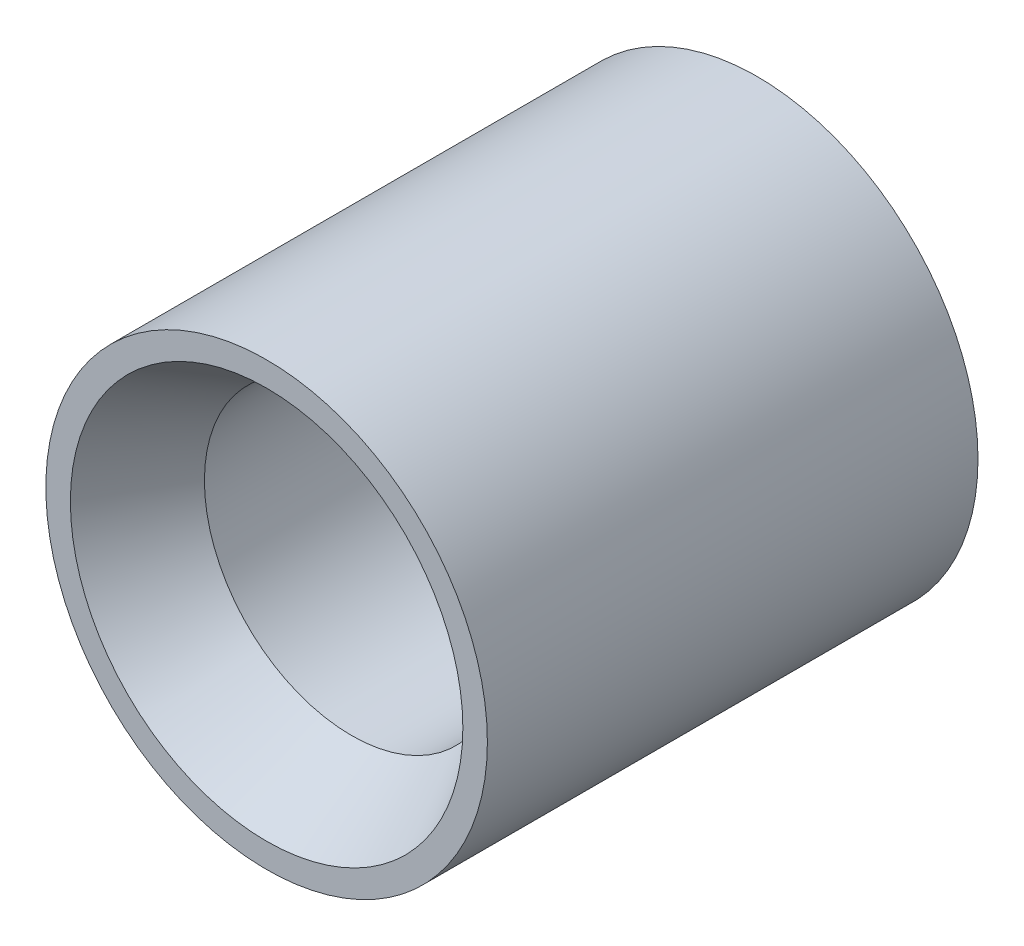
ISO-10303-21;
HEADER;
FILE_DESCRIPTION(('STEP AP214'),'2;1');
FILE_NAME('part.step','',(''),(''),'','','');
FILE_SCHEMA(('AUTOMOTIVE_DESIGN { 1 0 10303 214 1 1 1 1 }'));
ENDSEC;
DATA;
#1=APPLICATION_CONTEXT('core data for automotive mechanical design processes');
#2=APPLICATION_PROTOCOL_DEFINITION('international standard','automotive_design',2000,#1);
#3=PRODUCT_CONTEXT('',#1,'mechanical');
#4=PRODUCT('Part','Part','',(#3));
#5=PRODUCT_RELATED_PRODUCT_CATEGORY('part','',(#4));
#6=PRODUCT_DEFINITION_FORMATION('','',#4);
#7=PRODUCT_DEFINITION_CONTEXT('part definition',#1,'design');
#8=PRODUCT_DEFINITION('design','',#6,#7);
#9=PRODUCT_DEFINITION_SHAPE('','',#8);
#10=(LENGTH_UNIT() NAMED_UNIT(*) SI_UNIT(.MILLI.,.METRE.));
#11=(NAMED_UNIT(*) PLANE_ANGLE_UNIT() SI_UNIT($,.RADIAN.));
#12=(NAMED_UNIT(*) SI_UNIT($,.STERADIAN.) SOLID_ANGLE_UNIT());
#13=UNCERTAINTY_MEASURE_WITH_UNIT(LENGTH_MEASURE(1.E-05),#10,'distance_accuracy_value','');
#14=(GEOMETRIC_REPRESENTATION_CONTEXT(3) GLOBAL_UNCERTAINTY_ASSIGNED_CONTEXT((#13)) GLOBAL_UNIT_ASSIGNED_CONTEXT((#10,
#11,#12)) REPRESENTATION_CONTEXT('',''));
#15=CARTESIAN_POINT('',(0.,0.,0.));
#16=DIRECTION('',(0.,0.,1.));
#17=DIRECTION('',(1.,0.,0.));
#18=AXIS2_PLACEMENT_3D('',#15,#16,#17);
#19=CARTESIAN_POINT('',(0.,0.,10.));
#20=DIRECTION('',(0.,0.,1.));
#21=DIRECTION('',(1.,0.,0.));
#22=AXIS2_PLACEMENT_3D('',#19,#20,#21);
#23=PLANE('',#22);
#24=CARTESIAN_POINT('',(0.,0.,10.));
#25=DIRECTION('',(0.,0.,-1.));
#26=DIRECTION('',(-1.,0.,0.));
#27=AXIS2_PLACEMENT_3D('',#24,#25,#26);
#28=CIRCLE('',#27,4.);
#29=CARTESIAN_POINT('',(-4.,0.,10.));
#30=VERTEX_POINT('',#29);
#31=EDGE_CURVE('E63',#30,#30,#28,.T.);
#32=ORIENTED_EDGE('',*,*,#31,.T.);
#33=EDGE_LOOP('',(#32));
#34=FACE_BOUND('',#33,.T.);
#35=CARTESIAN_POINT('',(0.,0.,10.));
#36=DIRECTION('',(0.,0.,1.));
#37=DIRECTION('',(1.,0.,0.));
#38=AXIS2_PLACEMENT_3D('',#35,#36,#37);
#39=CIRCLE('',#38,4.5);
#40=CARTESIAN_POINT('',(4.5,0.,10.));
#41=VERTEX_POINT('',#40);
#42=EDGE_CURVE('E11',#41,#41,#39,.T.);
#43=ORIENTED_EDGE('',*,*,#42,.T.);
#44=EDGE_LOOP('',(#43));
#45=FACE_BOUND('',#44,.T.);
#46=ADVANCED_FACE('F43',(#34,#45),#23,.T.);
#47=CARTESIAN_POINT('',(0.,0.,0.));
#48=DIRECTION('',(0.,0.,1.));
#49=DIRECTION('',(1.,0.,0.));
#50=AXIS2_PLACEMENT_3D('',#47,#48,#49);
#51=PLANE('',#50);
#52=CARTESIAN_POINT('',(0.,0.,0.));
#53=DIRECTION('',(0.,0.,1.));
#54=DIRECTION('',(1.,0.,0.));
#55=AXIS2_PLACEMENT_3D('',#52,#53,#54);
#56=CIRCLE('',#55,4.5);
#57=CARTESIAN_POINT('',(4.5,0.,0.));
#58=VERTEX_POINT('',#57);
#59=EDGE_CURVE('E52',#58,#58,#56,.T.);
#60=ORIENTED_EDGE('',*,*,#59,.F.);
#61=EDGE_LOOP('',(#60));
#62=FACE_BOUND('',#61,.T.);
#63=CARTESIAN_POINT('',(0.,0.,0.));
#64=DIRECTION('',(0.,0.,1.));
#65=DIRECTION('',(1.,0.,0.));
#66=AXIS2_PLACEMENT_3D('',#63,#64,#65);
#67=CIRCLE('',#66,3.);
#68=CARTESIAN_POINT('',(3.,0.,0.));
#69=VERTEX_POINT('',#68);
#70=EDGE_CURVE('E58',#69,#69,#67,.T.);
#71=ORIENTED_EDGE('',*,*,#70,.T.);
#72=EDGE_LOOP('',(#71));
#73=FACE_BOUND('',#72,.T.);
#74=ADVANCED_FACE('F81',(#62,#73),#51,.F.);
#75=CARTESIAN_POINT('',(0.,0.,10.));
#76=DIRECTION('',(0.,0.,-1.));
#77=DIRECTION('',(-1.,0.,0.));
#78=AXIS2_PLACEMENT_3D('',#75,#76,#77);
#79=CYLINDRICAL_SURFACE('',#78,4.5);
#80=ORIENTED_EDGE('',*,*,#42,.F.);
#81=EDGE_LOOP('',(#80));
#82=FACE_BOUND('',#81,.T.);
#83=ORIENTED_EDGE('',*,*,#59,.T.);
#84=EDGE_LOOP('',(#83));
#85=FACE_BOUND('',#84,.T.);
#86=ADVANCED_FACE('F45',(#82,#85),#79,.T.);
#87=CARTESIAN_POINT('',(0.,0.,10.));
#88=DIRECTION('',(0.,0.,-1.));
#89=DIRECTION('',(-1.,0.,0.));
#90=AXIS2_PLACEMENT_3D('',#87,#88,#89);
#91=CYLINDRICAL_SURFACE('',#90,3.);
#92=CARTESIAN_POINT('',(0.,0.,8.2679491924311));
#93=DIRECTION('',(0.,0.,1.));
#94=DIRECTION('',(1.,0.,0.));
#95=AXIS2_PLACEMENT_3D('',#92,#93,#94);
#96=CIRCLE('',#95,3.);
#97=CARTESIAN_POINT('',(3.,0.,8.2679491924311));
#98=VERTEX_POINT('',#97);
#99=EDGE_CURVE('E47',#98,#98,#96,.F.);
#100=ORIENTED_EDGE('',*,*,#99,.F.);
#101=EDGE_LOOP('',(#100));
#102=FACE_BOUND('',#101,.T.);
#103=ORIENTED_EDGE('',*,*,#70,.F.);
#104=EDGE_LOOP('',(#103));
#105=FACE_BOUND('',#104,.T.);
#106=ADVANCED_FACE('F75',(#102,#105),#91,.F.);
#107=CARTESIAN_POINT('',(0.,0.,3.07179676972439));
#108=DIRECTION('',(0.,0.,1.));
#109=DIRECTION('',(1.,0.,0.));
#110=AXIS2_PLACEMENT_3D('',#107,#108,#109);
#111=CONICAL_SURFACE('',#110,0.,0.523598775598293);
#112=ORIENTED_EDGE('',*,*,#99,.T.);
#113=EDGE_LOOP('',(#112));
#114=FACE_BOUND('',#113,.T.);
#115=ORIENTED_EDGE('',*,*,#31,.F.);
#116=EDGE_LOOP('',(#115));
#117=FACE_BOUND('',#116,.T.);
#118=ADVANCED_FACE('F72',(#114,#117),#111,.F.);
#119=CLOSED_SHELL('',(#46,#74,#86,#106,#118));
#120=MANIFOLD_SOLID_BREP('B2',#119);
#121=ADVANCED_BREP_SHAPE_REPRESENTATION('',(#18,#120),#14);
#122=SHAPE_DEFINITION_REPRESENTATION(#9,#121);
ENDSEC;
END-ISO-10303-21;
